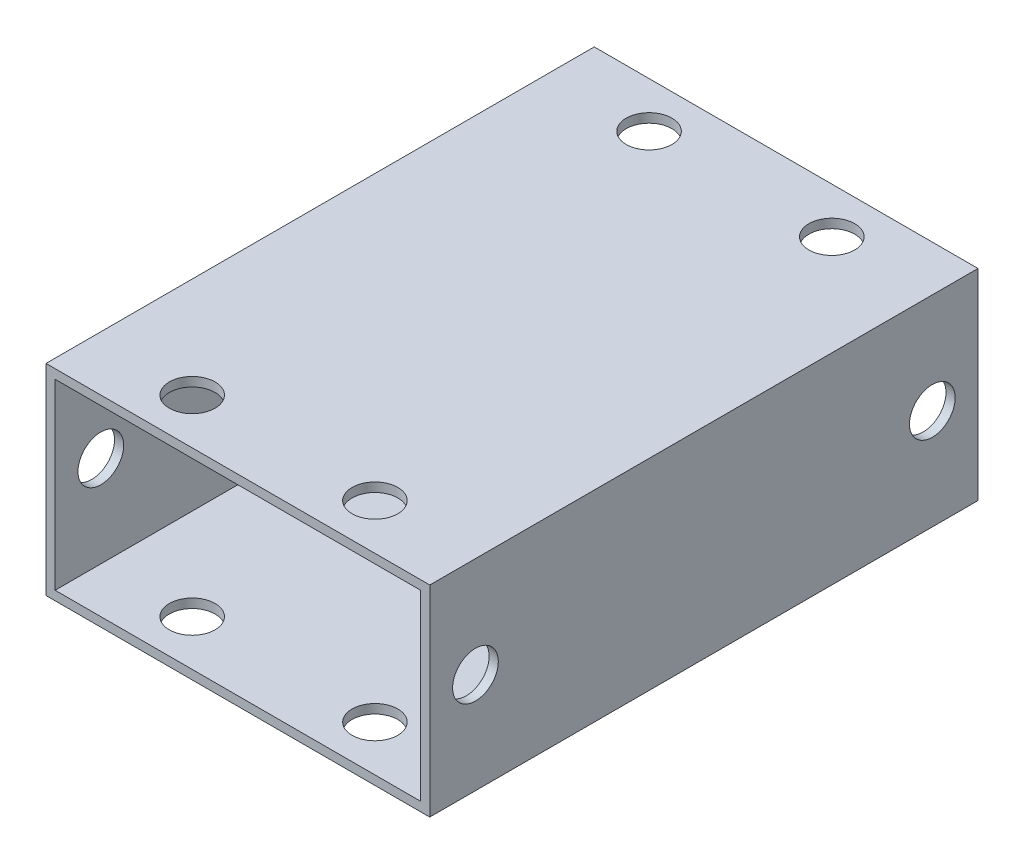
ISO-10303-21;
HEADER;
FILE_DESCRIPTION(('STEP AP214'),'2;1');
FILE_NAME('part.step','',(''),(''),'','','');
FILE_SCHEMA(('AUTOMOTIVE_DESIGN { 1 0 10303 214 1 1 1 1 }'));
ENDSEC;
DATA;
#1=APPLICATION_CONTEXT('core data for automotive mechanical design processes');
#2=APPLICATION_PROTOCOL_DEFINITION('international standard','automotive_design',2000,#1);
#3=PRODUCT_CONTEXT('',#1,'mechanical');
#4=PRODUCT('Part','Part','',(#3));
#5=PRODUCT_RELATED_PRODUCT_CATEGORY('part','',(#4));
#6=PRODUCT_DEFINITION_FORMATION('','',#4);
#7=PRODUCT_DEFINITION_CONTEXT('part definition',#1,'design');
#8=PRODUCT_DEFINITION('design','',#6,#7);
#9=PRODUCT_DEFINITION_SHAPE('','',#8);
#10=(LENGTH_UNIT() NAMED_UNIT(*) SI_UNIT(.MILLI.,.METRE.));
#11=(NAMED_UNIT(*) PLANE_ANGLE_UNIT() SI_UNIT($,.RADIAN.));
#12=(NAMED_UNIT(*) SI_UNIT($,.STERADIAN.) SOLID_ANGLE_UNIT());
#13=UNCERTAINTY_MEASURE_WITH_UNIT(LENGTH_MEASURE(1.E-05),#10,'distance_accuracy_value','');
#14=(GEOMETRIC_REPRESENTATION_CONTEXT(3) GLOBAL_UNCERTAINTY_ASSIGNED_CONTEXT((#13)) GLOBAL_UNIT_ASSIGNED_CONTEXT((#10,
#11,#12)) REPRESENTATION_CONTEXT('',''));
#15=CARTESIAN_POINT('',(0.,0.,0.));
#16=DIRECTION('',(0.,0.,1.));
#17=DIRECTION('',(1.,0.,0.));
#18=AXIS2_PLACEMENT_3D('',#15,#16,#17);
#19=CARTESIAN_POINT('',(20.,-10.,60.));
#20=DIRECTION('',(1.,0.,0.));
#21=DIRECTION('',(0.,0.,-1.));
#22=AXIS2_PLACEMENT_3D('',#19,#20,#21);
#23=PLANE('',#22);
#24=CARTESIAN_POINT('',(20.,0.,5.));
#25=DIRECTION('',(1.,0.,0.));
#26=DIRECTION('',(0.,0.,-1.));
#27=AXIS2_PLACEMENT_3D('',#24,#25,#26);
#28=CIRCLE('',#27,2.5);
#29=CARTESIAN_POINT('',(20.,0.,2.5));
#30=VERTEX_POINT('',#29);
#31=EDGE_CURVE('E143',#30,#30,#28,.T.);
#32=ORIENTED_EDGE('',*,*,#31,.T.);
#33=EDGE_LOOP('',(#32));
#34=FACE_BOUND('',#33,.T.);
#35=CARTESIAN_POINT('',(20.,0.,55.));
#36=DIRECTION('',(1.,0.,0.));
#37=DIRECTION('',(0.,0.,-1.));
#38=AXIS2_PLACEMENT_3D('',#35,#36,#37);
#39=CIRCLE('',#38,2.5);
#40=CARTESIAN_POINT('',(20.,0.,52.5));
#41=VERTEX_POINT('',#40);
#42=EDGE_CURVE('E140',#41,#41,#39,.T.);
#43=ORIENTED_EDGE('',*,*,#42,.T.);
#44=EDGE_LOOP('',(#43));
#45=FACE_BOUND('',#44,.T.);
#46=DIRECTION('',(0.,-1.,0.));
#47=VECTOR('',#46,1.);
#48=CARTESIAN_POINT('',(20.,-10.,0.));
#49=LINE('',#48,#47);
#50=CARTESIAN_POINT('',(20.,10.,0.));
#51=VERTEX_POINT('',#50);
#52=CARTESIAN_POINT('',(20.,-10.,0.));
#53=VERTEX_POINT('',#52);
#54=EDGE_CURVE('E168',#51,#53,#49,.T.);
#55=ORIENTED_EDGE('',*,*,#54,.T.);
#56=DIRECTION('',(0.,0.,-1.));
#57=VECTOR('',#56,1.);
#58=CARTESIAN_POINT('',(20.,-10.,60.));
#59=LINE('',#58,#57);
#60=CARTESIAN_POINT('',(20.,-10.,60.));
#61=VERTEX_POINT('',#60);
#62=EDGE_CURVE('E11',#61,#53,#59,.T.);
#63=ORIENTED_EDGE('',*,*,#62,.F.);
#64=DIRECTION('',(0.,-1.,0.));
#65=VECTOR('',#64,1.);
#66=CARTESIAN_POINT('',(20.,-10.,60.));
#67=LINE('',#66,#65);
#68=CARTESIAN_POINT('',(20.,10.,60.));
#69=VERTEX_POINT('',#68);
#70=EDGE_CURVE('E88',#69,#61,#67,.T.);
#71=ORIENTED_EDGE('',*,*,#70,.F.);
#72=DIRECTION('',(0.,0.,-1.));
#73=VECTOR('',#72,1.);
#74=CARTESIAN_POINT('',(20.,10.,60.));
#75=LINE('',#74,#73);
#76=EDGE_CURVE('E179',#69,#51,#75,.T.);
#77=ORIENTED_EDGE('',*,*,#76,.T.);
#78=EDGE_LOOP('',(#55,#63,#71,#77));
#79=FACE_BOUND('',#78,.T.);
#80=ADVANCED_FACE('F37',(#34,#45,#79),#23,.F.);
#81=CARTESIAN_POINT('',(21.,-10.,60.));
#82=DIRECTION('',(-1.,0.,0.));
#83=DIRECTION('',(0.,0.,1.));
#84=AXIS2_PLACEMENT_3D('',#81,#82,#83);
#85=PLANE('',#84);
#86=CARTESIAN_POINT('',(21.,0.,5.));
#87=DIRECTION('',(-1.,0.,0.));
#88=DIRECTION('',(0.,0.,1.));
#89=AXIS2_PLACEMENT_3D('',#86,#87,#88);
#90=CIRCLE('',#89,2.5);
#91=CARTESIAN_POINT('',(21.,0.,7.5));
#92=VERTEX_POINT('',#91);
#93=EDGE_CURVE('E130',#92,#92,#90,.T.);
#94=ORIENTED_EDGE('',*,*,#93,.T.);
#95=EDGE_LOOP('',(#94));
#96=FACE_BOUND('',#95,.T.);
#97=CARTESIAN_POINT('',(21.,0.,55.));
#98=DIRECTION('',(-1.,0.,0.));
#99=DIRECTION('',(0.,0.,-1.));
#100=AXIS2_PLACEMENT_3D('',#97,#98,#99);
#101=CIRCLE('',#100,2.5);
#102=CARTESIAN_POINT('',(21.,0.,52.5));
#103=VERTEX_POINT('',#102);
#104=EDGE_CURVE('E135',#103,#103,#101,.T.);
#105=ORIENTED_EDGE('',*,*,#104,.T.);
#106=EDGE_LOOP('',(#105));
#107=FACE_BOUND('',#106,.T.);
#108=DIRECTION('',(0.,1.,0.));
#109=VECTOR('',#108,1.);
#110=CARTESIAN_POINT('',(21.,-10.,0.));
#111=LINE('',#110,#109);
#112=CARTESIAN_POINT('',(21.,-11.,0.));
#113=VERTEX_POINT('',#112);
#114=CARTESIAN_POINT('',(21.,11.,0.));
#115=VERTEX_POINT('',#114);
#116=EDGE_CURVE('E181',#113,#115,#111,.T.);
#117=ORIENTED_EDGE('',*,*,#116,.T.);
#118=DIRECTION('',(0.,0.,-1.));
#119=VECTOR('',#118,1.);
#120=CARTESIAN_POINT('',(21.,11.,60.));
#121=LINE('',#120,#119);
#122=CARTESIAN_POINT('',(21.,11.,60.));
#123=VERTEX_POINT('',#122);
#124=EDGE_CURVE('E46',#123,#115,#121,.T.);
#125=ORIENTED_EDGE('',*,*,#124,.F.);
#126=DIRECTION('',(0.,1.,0.));
#127=VECTOR('',#126,1.);
#128=CARTESIAN_POINT('',(21.,-10.,60.));
#129=LINE('',#128,#127);
#130=CARTESIAN_POINT('',(21.,-11.,60.));
#131=VERTEX_POINT('',#130);
#132=EDGE_CURVE('E172',#131,#123,#129,.T.);
#133=ORIENTED_EDGE('',*,*,#132,.F.);
#134=DIRECTION('',(0.,0.,1.));
#135=VECTOR('',#134,1.);
#136=CARTESIAN_POINT('',(21.,-11.,60.));
#137=LINE('',#136,#135);
#138=EDGE_CURVE('E118',#113,#131,#137,.T.);
#139=ORIENTED_EDGE('',*,*,#138,.F.);
#140=EDGE_LOOP('',(#117,#125,#133,#139));
#141=FACE_BOUND('',#140,.T.);
#142=ADVANCED_FACE('F220',(#96,#107,#141),#85,.F.);
#143=CARTESIAN_POINT('',(-21.,11.,60.));
#144=DIRECTION('',(0.,-1.,0.));
#145=DIRECTION('',(0.,0.,-1.));
#146=AXIS2_PLACEMENT_3D('',#143,#144,#145);
#147=PLANE('',#146);
#148=CARTESIAN_POINT('',(-10.,11.,5.));
#149=DIRECTION('',(0.,-1.,0.));
#150=DIRECTION('',(0.,0.,1.));
#151=AXIS2_PLACEMENT_3D('',#148,#149,#150);
#152=CIRCLE('',#151,2.5);
#153=CARTESIAN_POINT('',(-10.,11.,7.5));
#154=VERTEX_POINT('',#153);
#155=EDGE_CURVE('E146',#154,#154,#152,.T.);
#156=ORIENTED_EDGE('',*,*,#155,.T.);
#157=EDGE_LOOP('',(#156));
#158=FACE_BOUND('',#157,.T.);
#159=CARTESIAN_POINT('',(-10.,11.,55.));
#160=DIRECTION('',(0.,-1.,0.));
#161=DIRECTION('',(0.,0.,-1.));
#162=AXIS2_PLACEMENT_3D('',#159,#160,#161);
#163=CIRCLE('',#162,2.5);
#164=CARTESIAN_POINT('',(-10.,11.,52.5));
#165=VERTEX_POINT('',#164);
#166=EDGE_CURVE('E157',#165,#165,#163,.T.);
#167=ORIENTED_EDGE('',*,*,#166,.T.);
#168=EDGE_LOOP('',(#167));
#169=FACE_BOUND('',#168,.T.);
#170=CARTESIAN_POINT('',(10.,11.,55.));
#171=DIRECTION('',(0.,-1.,0.));
#172=DIRECTION('',(0.,0.,1.));
#173=AXIS2_PLACEMENT_3D('',#170,#171,#172);
#174=CIRCLE('',#173,2.5);
#175=CARTESIAN_POINT('',(10.,11.,57.5));
#176=VERTEX_POINT('',#175);
#177=EDGE_CURVE('E151',#176,#176,#174,.T.);
#178=ORIENTED_EDGE('',*,*,#177,.T.);
#179=EDGE_LOOP('',(#178));
#180=FACE_BOUND('',#179,.T.);
#181=CARTESIAN_POINT('',(10.,11.,5.));
#182=DIRECTION('',(0.,-1.,0.));
#183=DIRECTION('',(0.,0.,-1.));
#184=AXIS2_PLACEMENT_3D('',#181,#182,#183);
#185=CIRCLE('',#184,2.5);
#186=CARTESIAN_POINT('',(10.,11.,2.5));
#187=VERTEX_POINT('',#186);
#188=EDGE_CURVE('E165',#187,#187,#185,.T.);
#189=ORIENTED_EDGE('',*,*,#188,.T.);
#190=EDGE_LOOP('',(#189));
#191=FACE_BOUND('',#190,.T.);
#192=DIRECTION('',(-1.,0.,0.));
#193=VECTOR('',#192,1.);
#194=CARTESIAN_POINT('',(-21.,11.,0.));
#195=LINE('',#194,#193);
#196=CARTESIAN_POINT('',(-21.,11.,0.));
#197=VERTEX_POINT('',#196);
#198=EDGE_CURVE('E183',#115,#197,#195,.T.);
#199=ORIENTED_EDGE('',*,*,#198,.T.);
#200=DIRECTION('',(0.,0.,-1.));
#201=VECTOR('',#200,1.);
#202=CARTESIAN_POINT('',(-21.,11.,60.));
#203=LINE('',#202,#201);
#204=CARTESIAN_POINT('',(-21.,11.,60.));
#205=VERTEX_POINT('',#204);
#206=EDGE_CURVE('E112',#205,#197,#203,.T.);
#207=ORIENTED_EDGE('',*,*,#206,.F.);
#208=DIRECTION('',(-1.,0.,0.));
#209=VECTOR('',#208,1.);
#210=CARTESIAN_POINT('',(-21.,11.,60.));
#211=LINE('',#210,#209);
#212=EDGE_CURVE('E174',#123,#205,#211,.T.);
#213=ORIENTED_EDGE('',*,*,#212,.F.);
#214=ORIENTED_EDGE('',*,*,#124,.T.);
#215=EDGE_LOOP('',(#199,#207,#213,#214));
#216=FACE_BOUND('',#215,.T.);
#217=ADVANCED_FACE('F227',(#158,#169,#180,#191,#216),#147,.F.);
#218=CARTESIAN_POINT('',(-21.,-10.,60.));
#219=DIRECTION('',(1.,0.,0.));
#220=DIRECTION('',(0.,0.,-1.));
#221=AXIS2_PLACEMENT_3D('',#218,#219,#220);
#222=PLANE('',#221);
#223=CARTESIAN_POINT('',(-21.,0.,5.));
#224=DIRECTION('',(-1.,0.,0.));
#225=DIRECTION('',(0.,0.,1.));
#226=AXIS2_PLACEMENT_3D('',#223,#224,#225);
#227=CIRCLE('',#226,2.5);
#228=CARTESIAN_POINT('',(-21.,0.,7.5));
#229=VERTEX_POINT('',#228);
#230=EDGE_CURVE('E127',#229,#229,#227,.T.);
#231=ORIENTED_EDGE('',*,*,#230,.F.);
#232=EDGE_LOOP('',(#231));
#233=FACE_BOUND('',#232,.T.);
#234=CARTESIAN_POINT('',(-21.,0.,55.));
#235=DIRECTION('',(-1.,0.,0.));
#236=DIRECTION('',(0.,0.,-1.));
#237=AXIS2_PLACEMENT_3D('',#234,#235,#236);
#238=CIRCLE('',#237,2.5);
#239=CARTESIAN_POINT('',(-21.,0.,52.5));
#240=VERTEX_POINT('',#239);
#241=EDGE_CURVE('E131',#240,#240,#238,.T.);
#242=ORIENTED_EDGE('',*,*,#241,.F.);
#243=EDGE_LOOP('',(#242));
#244=FACE_BOUND('',#243,.T.);
#245=DIRECTION('',(0.,-1.,0.));
#246=VECTOR('',#245,1.);
#247=CARTESIAN_POINT('',(-21.,-10.,0.));
#248=LINE('',#247,#246);
#249=CARTESIAN_POINT('',(-21.,-11.,0.));
#250=VERTEX_POINT('',#249);
#251=EDGE_CURVE('E185',#197,#250,#248,.T.);
#252=ORIENTED_EDGE('',*,*,#251,.T.);
#253=DIRECTION('',(0.,0.,-1.));
#254=VECTOR('',#253,1.);
#255=CARTESIAN_POINT('',(-21.,-11.,60.));
#256=LINE('',#255,#254);
#257=CARTESIAN_POINT('',(-21.,-11.,60.));
#258=VERTEX_POINT('',#257);
#259=EDGE_CURVE('E261',#258,#250,#256,.T.);
#260=ORIENTED_EDGE('',*,*,#259,.F.);
#261=DIRECTION('',(0.,-1.,0.));
#262=VECTOR('',#261,1.);
#263=CARTESIAN_POINT('',(-21.,-10.,60.));
#264=LINE('',#263,#262);
#265=EDGE_CURVE('E104',#205,#258,#264,.T.);
#266=ORIENTED_EDGE('',*,*,#265,.F.);
#267=ORIENTED_EDGE('',*,*,#206,.T.);
#268=EDGE_LOOP('',(#252,#260,#266,#267));
#269=FACE_BOUND('',#268,.T.);
#270=ADVANCED_FACE('F269',(#233,#244,#269),#222,.F.);
#271=CARTESIAN_POINT('',(-20.,-10.,60.));
#272=DIRECTION('',(-1.,0.,0.));
#273=DIRECTION('',(0.,0.,1.));
#274=AXIS2_PLACEMENT_3D('',#271,#272,#273);
#275=PLANE('',#274);
#276=CARTESIAN_POINT('',(-20.,0.,5.));
#277=DIRECTION('',(-1.,0.,0.));
#278=DIRECTION('',(0.,0.,1.));
#279=AXIS2_PLACEMENT_3D('',#276,#277,#278);
#280=CIRCLE('',#279,2.5);
#281=CARTESIAN_POINT('',(-20.,0.,7.5));
#282=VERTEX_POINT('',#281);
#283=EDGE_CURVE('E40',#282,#282,#280,.T.);
#284=ORIENTED_EDGE('',*,*,#283,.T.);
#285=EDGE_LOOP('',(#284));
#286=FACE_BOUND('',#285,.T.);
#287=CARTESIAN_POINT('',(-20.,0.,55.));
#288=DIRECTION('',(-1.,0.,0.));
#289=DIRECTION('',(0.,0.,1.));
#290=AXIS2_PLACEMENT_3D('',#287,#288,#289);
#291=CIRCLE('',#290,2.5);
#292=CARTESIAN_POINT('',(-20.,0.,57.5));
#293=VERTEX_POINT('',#292);
#294=EDGE_CURVE('E134',#293,#293,#291,.T.);
#295=ORIENTED_EDGE('',*,*,#294,.T.);
#296=EDGE_LOOP('',(#295));
#297=FACE_BOUND('',#296,.T.);
#298=DIRECTION('',(0.,1.,0.));
#299=VECTOR('',#298,1.);
#300=CARTESIAN_POINT('',(-20.,-10.,0.));
#301=LINE('',#300,#299);
#302=CARTESIAN_POINT('',(-20.,-10.,0.));
#303=VERTEX_POINT('',#302);
#304=CARTESIAN_POINT('',(-20.,10.,0.));
#305=VERTEX_POINT('',#304);
#306=EDGE_CURVE('E76',#303,#305,#301,.T.);
#307=ORIENTED_EDGE('',*,*,#306,.T.);
#308=DIRECTION('',(0.,0.,-1.));
#309=VECTOR('',#308,1.);
#310=CARTESIAN_POINT('',(-20.,10.,60.));
#311=LINE('',#310,#309);
#312=CARTESIAN_POINT('',(-20.,10.,60.));
#313=VERTEX_POINT('',#312);
#314=EDGE_CURVE('E103',#313,#305,#311,.T.);
#315=ORIENTED_EDGE('',*,*,#314,.F.);
#316=DIRECTION('',(0.,1.,0.));
#317=VECTOR('',#316,1.);
#318=CARTESIAN_POINT('',(-20.,-10.,60.));
#319=LINE('',#318,#317);
#320=CARTESIAN_POINT('',(-20.,-10.,60.));
#321=VERTEX_POINT('',#320);
#322=EDGE_CURVE('E98',#321,#313,#319,.T.);
#323=ORIENTED_EDGE('',*,*,#322,.F.);
#324=DIRECTION('',(0.,0.,-1.));
#325=VECTOR('',#324,1.);
#326=CARTESIAN_POINT('',(-20.,-10.,60.));
#327=LINE('',#326,#325);
#328=EDGE_CURVE('E101',#321,#303,#327,.T.);
#329=ORIENTED_EDGE('',*,*,#328,.T.);
#330=EDGE_LOOP('',(#307,#315,#323,#329));
#331=FACE_BOUND('',#330,.T.);
#332=ADVANCED_FACE('F100',(#286,#297,#331),#275,.F.);
#333=CARTESIAN_POINT('',(-20.,10.,60.));
#334=DIRECTION('',(0.,1.,0.));
#335=DIRECTION('',(0.,0.,1.));
#336=AXIS2_PLACEMENT_3D('',#333,#334,#335);
#337=PLANE('',#336);
#338=CARTESIAN_POINT('',(-10.,10.,5.));
#339=DIRECTION('',(0.,-1.,0.));
#340=DIRECTION('',(0.,0.,1.));
#341=AXIS2_PLACEMENT_3D('',#338,#339,#340);
#342=CIRCLE('',#341,2.5);
#343=CARTESIAN_POINT('',(-10.,10.,7.5));
#344=VERTEX_POINT('',#343);
#345=EDGE_CURVE('E160',#344,#344,#342,.T.);
#346=ORIENTED_EDGE('',*,*,#345,.F.);
#347=EDGE_LOOP('',(#346));
#348=FACE_BOUND('',#347,.T.);
#349=CARTESIAN_POINT('',(-10.,10.,55.));
#350=DIRECTION('',(0.,-1.,0.));
#351=DIRECTION('',(0.,0.,-1.));
#352=AXIS2_PLACEMENT_3D('',#349,#350,#351);
#353=CIRCLE('',#352,2.5);
#354=CARTESIAN_POINT('',(-10.,10.,52.5));
#355=VERTEX_POINT('',#354);
#356=EDGE_CURVE('E154',#355,#355,#353,.T.);
#357=ORIENTED_EDGE('',*,*,#356,.F.);
#358=EDGE_LOOP('',(#357));
#359=FACE_BOUND('',#358,.T.);
#360=CARTESIAN_POINT('',(10.,10.,55.));
#361=DIRECTION('',(0.,-1.,0.));
#362=DIRECTION('',(0.,0.,1.));
#363=AXIS2_PLACEMENT_3D('',#360,#361,#362);
#364=CIRCLE('',#363,2.5);
#365=CARTESIAN_POINT('',(10.,10.,57.5));
#366=VERTEX_POINT('',#365);
#367=EDGE_CURVE('E147',#366,#366,#364,.T.);
#368=ORIENTED_EDGE('',*,*,#367,.F.);
#369=EDGE_LOOP('',(#368));
#370=FACE_BOUND('',#369,.T.);
#371=CARTESIAN_POINT('',(10.,10.,5.));
#372=DIRECTION('',(0.,-1.,0.));
#373=DIRECTION('',(0.,0.,-1.));
#374=AXIS2_PLACEMENT_3D('',#371,#372,#373);
#375=CIRCLE('',#374,2.5);
#376=CARTESIAN_POINT('',(10.,10.,2.5));
#377=VERTEX_POINT('',#376);
#378=EDGE_CURVE('E150',#377,#377,#375,.T.);
#379=ORIENTED_EDGE('',*,*,#378,.F.);
#380=EDGE_LOOP('',(#379));
#381=FACE_BOUND('',#380,.T.);
#382=DIRECTION('',(1.,0.,0.));
#383=VECTOR('',#382,1.);
#384=CARTESIAN_POINT('',(-20.,10.,0.));
#385=LINE('',#384,#383);
#386=EDGE_CURVE('E82',#305,#51,#385,.T.);
#387=ORIENTED_EDGE('',*,*,#386,.T.);
#388=ORIENTED_EDGE('',*,*,#76,.F.);
#389=DIRECTION('',(1.,0.,0.));
#390=VECTOR('',#389,1.);
#391=CARTESIAN_POINT('',(-20.,10.,60.));
#392=LINE('',#391,#390);
#393=EDGE_CURVE('E55',#313,#69,#392,.T.);
#394=ORIENTED_EDGE('',*,*,#393,.F.);
#395=ORIENTED_EDGE('',*,*,#314,.T.);
#396=EDGE_LOOP('',(#387,#388,#394,#395));
#397=FACE_BOUND('',#396,.T.);
#398=ADVANCED_FACE('F285',(#348,#359,#370,#381,#397),#337,.F.);
#399=CARTESIAN_POINT('',(0.,0.,60.));
#400=DIRECTION('',(0.,0.,-1.));
#401=DIRECTION('',(-1.,0.,0.));
#402=AXIS2_PLACEMENT_3D('',#399,#400,#401);
#403=PLANE('',#402);
#404=DIRECTION('',(-1.,0.,0.));
#405=VECTOR('',#404,1.);
#406=CARTESIAN_POINT('',(21.,-10.,60.));
#407=LINE('',#406,#405);
#408=EDGE_CURVE('E109',#61,#321,#407,.T.);
#409=ORIENTED_EDGE('',*,*,#408,.T.);
#410=ORIENTED_EDGE('',*,*,#322,.T.);
#411=ORIENTED_EDGE('',*,*,#393,.T.);
#412=ORIENTED_EDGE('',*,*,#70,.T.);
#413=EDGE_LOOP('',(#409,#410,#411,#412));
#414=FACE_BOUND('',#413,.T.);
#415=ORIENTED_EDGE('',*,*,#265,.T.);
#416=DIRECTION('',(-1.,0.,0.));
#417=VECTOR('',#416,1.);
#418=CARTESIAN_POINT('',(21.,-11.,60.));
#419=LINE('',#418,#417);
#420=EDGE_CURVE('E256',#131,#258,#419,.T.);
#421=ORIENTED_EDGE('',*,*,#420,.F.);
#422=ORIENTED_EDGE('',*,*,#132,.T.);
#423=ORIENTED_EDGE('',*,*,#212,.T.);
#424=EDGE_LOOP('',(#415,#421,#422,#423));
#425=FACE_BOUND('',#424,.T.);
#426=ADVANCED_FACE('F114',(#414,#425),#403,.F.);
#427=CARTESIAN_POINT('',(0.,0.,0.));
#428=DIRECTION('',(0.,0.,-1.));
#429=DIRECTION('',(-1.,0.,0.));
#430=AXIS2_PLACEMENT_3D('',#427,#428,#429);
#431=PLANE('',#430);
#432=ORIENTED_EDGE('',*,*,#306,.F.);
#433=DIRECTION('',(1.,0.,0.));
#434=VECTOR('',#433,1.);
#435=CARTESIAN_POINT('',(21.,-10.,0.));
#436=LINE('',#435,#434);
#437=EDGE_CURVE('E111',#303,#53,#436,.T.);
#438=ORIENTED_EDGE('',*,*,#437,.T.);
#439=ORIENTED_EDGE('',*,*,#54,.F.);
#440=ORIENTED_EDGE('',*,*,#386,.F.);
#441=EDGE_LOOP('',(#432,#438,#439,#440));
#442=FACE_BOUND('',#441,.T.);
#443=DIRECTION('',(1.,0.,0.));
#444=VECTOR('',#443,1.);
#445=CARTESIAN_POINT('',(21.,-11.,0.));
#446=LINE('',#445,#444);
#447=EDGE_CURVE('E124',#250,#113,#446,.T.);
#448=ORIENTED_EDGE('',*,*,#447,.F.);
#449=ORIENTED_EDGE('',*,*,#251,.F.);
#450=ORIENTED_EDGE('',*,*,#198,.F.);
#451=ORIENTED_EDGE('',*,*,#116,.F.);
#452=EDGE_LOOP('',(#448,#449,#450,#451));
#453=FACE_BOUND('',#452,.T.);
#454=ADVANCED_FACE('F235',(#442,#453),#431,.T.);
#455=CARTESIAN_POINT('',(10.,11.,5.));
#456=DIRECTION('',(0.,-1.,0.));
#457=DIRECTION('',(0.,0.,-1.));
#458=AXIS2_PLACEMENT_3D('',#455,#456,#457);
#459=CYLINDRICAL_SURFACE('',#458,2.5);
#460=ORIENTED_EDGE('',*,*,#188,.F.);
#461=EDGE_LOOP('',(#460));
#462=FACE_BOUND('',#461,.T.);
#463=ORIENTED_EDGE('',*,*,#378,.T.);
#464=EDGE_LOOP('',(#463));
#465=FACE_BOUND('',#464,.T.);
#466=ADVANCED_FACE('F292',(#462,#465),#459,.F.);
#467=CARTESIAN_POINT('',(10.,11.,55.));
#468=DIRECTION('',(0.,-1.,0.));
#469=DIRECTION('',(0.,0.,-1.));
#470=AXIS2_PLACEMENT_3D('',#467,#468,#469);
#471=CYLINDRICAL_SURFACE('',#470,2.5);
#472=ORIENTED_EDGE('',*,*,#177,.F.);
#473=EDGE_LOOP('',(#472));
#474=FACE_BOUND('',#473,.T.);
#475=ORIENTED_EDGE('',*,*,#367,.T.);
#476=EDGE_LOOP('',(#475));
#477=FACE_BOUND('',#476,.T.);
#478=ADVANCED_FACE('F296',(#474,#477),#471,.F.);
#479=CARTESIAN_POINT('',(-10.,11.,55.));
#480=DIRECTION('',(0.,-1.,0.));
#481=DIRECTION('',(0.,0.,-1.));
#482=AXIS2_PLACEMENT_3D('',#479,#480,#481);
#483=CYLINDRICAL_SURFACE('',#482,2.5);
#484=ORIENTED_EDGE('',*,*,#166,.F.);
#485=EDGE_LOOP('',(#484));
#486=FACE_BOUND('',#485,.T.);
#487=ORIENTED_EDGE('',*,*,#356,.T.);
#488=EDGE_LOOP('',(#487));
#489=FACE_BOUND('',#488,.T.);
#490=ADVANCED_FACE('F213',(#486,#489),#483,.F.);
#491=CARTESIAN_POINT('',(-10.,11.,5.));
#492=DIRECTION('',(0.,-1.,0.));
#493=DIRECTION('',(0.,0.,-1.));
#494=AXIS2_PLACEMENT_3D('',#491,#492,#493);
#495=CYLINDRICAL_SURFACE('',#494,2.5);
#496=ORIENTED_EDGE('',*,*,#155,.F.);
#497=EDGE_LOOP('',(#496));
#498=FACE_BOUND('',#497,.T.);
#499=ORIENTED_EDGE('',*,*,#345,.T.);
#500=EDGE_LOOP('',(#499));
#501=FACE_BOUND('',#500,.T.);
#502=ADVANCED_FACE('F202',(#498,#501),#495,.F.);
#503=CARTESIAN_POINT('',(21.,0.,55.));
#504=DIRECTION('',(-1.,0.,0.));
#505=DIRECTION('',(0.,0.,1.));
#506=AXIS2_PLACEMENT_3D('',#503,#504,#505);
#507=CYLINDRICAL_SURFACE('',#506,2.5);
#508=ORIENTED_EDGE('',*,*,#241,.T.);
#509=EDGE_LOOP('',(#508));
#510=FACE_BOUND('',#509,.T.);
#511=ORIENTED_EDGE('',*,*,#294,.F.);
#512=EDGE_LOOP('',(#511));
#513=FACE_BOUND('',#512,.T.);
#514=ADVANCED_FACE('F199',(#510,#513),#507,.F.);
#515=CARTESIAN_POINT('',(21.,0.,5.));
#516=DIRECTION('',(-1.,0.,0.));
#517=DIRECTION('',(0.,0.,1.));
#518=AXIS2_PLACEMENT_3D('',#515,#516,#517);
#519=CYLINDRICAL_SURFACE('',#518,2.5);
#520=ORIENTED_EDGE('',*,*,#230,.T.);
#521=EDGE_LOOP('',(#520));
#522=FACE_BOUND('',#521,.T.);
#523=ORIENTED_EDGE('',*,*,#283,.F.);
#524=EDGE_LOOP('',(#523));
#525=FACE_BOUND('',#524,.T.);
#526=ADVANCED_FACE('F201',(#522,#525),#519,.F.);
#527=ORIENTED_EDGE('',*,*,#104,.F.);
#528=EDGE_LOOP('',(#527));
#529=FACE_BOUND('',#528,.T.);
#530=ORIENTED_EDGE('',*,*,#42,.F.);
#531=EDGE_LOOP('',(#530));
#532=FACE_BOUND('',#531,.T.);
#533=ADVANCED_FACE('F205',(#529,#532),#507,.F.);
#534=ORIENTED_EDGE('',*,*,#93,.F.);
#535=EDGE_LOOP('',(#534));
#536=FACE_BOUND('',#535,.T.);
#537=ORIENTED_EDGE('',*,*,#31,.F.);
#538=EDGE_LOOP('',(#537));
#539=FACE_BOUND('',#538,.T.);
#540=ADVANCED_FACE('F212',(#536,#539),#519,.F.);
#541=CARTESIAN_POINT('',(0.,-10.,0.));
#542=DIRECTION('',(0.,1.,0.));
#543=DIRECTION('',(0.,0.,1.));
#544=AXIS2_PLACEMENT_3D('',#541,#542,#543);
#545=PLANE('',#544);
#546=CARTESIAN_POINT('',(10.,-10.,55.));
#547=DIRECTION('',(0.,-1.,0.));
#548=DIRECTION('',(0.,0.,-1.));
#549=AXIS2_PLACEMENT_3D('',#546,#547,#548);
#550=CIRCLE('',#549,2.5);
#551=CARTESIAN_POINT('',(10.,-10.,52.5));
#552=VERTEX_POINT('',#551);
#553=EDGE_CURVE('E524',#552,#552,#550,.T.);
#554=ORIENTED_EDGE('',*,*,#553,.T.);
#555=EDGE_LOOP('',(#554));
#556=FACE_BOUND('',#555,.T.);
#557=CARTESIAN_POINT('',(-10.,-10.,5.));
#558=DIRECTION('',(0.,-1.,0.));
#559=DIRECTION('',(0.,0.,-1.));
#560=AXIS2_PLACEMENT_3D('',#557,#558,#559);
#561=CIRCLE('',#560,2.5);
#562=CARTESIAN_POINT('',(-10.,-10.,2.5));
#563=VERTEX_POINT('',#562);
#564=EDGE_CURVE('E121',#563,#563,#561,.T.);
#565=ORIENTED_EDGE('',*,*,#564,.T.);
#566=EDGE_LOOP('',(#565));
#567=FACE_BOUND('',#566,.T.);
#568=CARTESIAN_POINT('',(-10.,-10.,55.));
#569=DIRECTION('',(0.,-1.,0.));
#570=DIRECTION('',(0.,0.,-1.));
#571=AXIS2_PLACEMENT_3D('',#568,#569,#570);
#572=CIRCLE('',#571,2.5);
#573=CARTESIAN_POINT('',(-10.,-10.,52.5));
#574=VERTEX_POINT('',#573);
#575=EDGE_CURVE('E530',#574,#574,#572,.T.);
#576=ORIENTED_EDGE('',*,*,#575,.T.);
#577=EDGE_LOOP('',(#576));
#578=FACE_BOUND('',#577,.T.);
#579=CARTESIAN_POINT('',(10.,-10.,5.));
#580=DIRECTION('',(0.,-1.,0.));
#581=DIRECTION('',(0.,0.,-1.));
#582=AXIS2_PLACEMENT_3D('',#579,#580,#581);
#583=CIRCLE('',#582,2.5);
#584=CARTESIAN_POINT('',(10.,-10.,2.5));
#585=VERTEX_POINT('',#584);
#586=EDGE_CURVE('E521',#585,#585,#583,.T.);
#587=ORIENTED_EDGE('',*,*,#586,.T.);
#588=EDGE_LOOP('',(#587));
#589=FACE_BOUND('',#588,.T.);
#590=ORIENTED_EDGE('',*,*,#62,.T.);
#591=ORIENTED_EDGE('',*,*,#437,.F.);
#592=ORIENTED_EDGE('',*,*,#328,.F.);
#593=ORIENTED_EDGE('',*,*,#408,.F.);
#594=EDGE_LOOP('',(#590,#591,#592,#593));
#595=FACE_BOUND('',#594,.T.);
#596=ADVANCED_FACE('F108',(#556,#567,#578,#589,#595),#545,.T.);
#597=CARTESIAN_POINT('',(0.,-11.,0.));
#598=DIRECTION('',(0.,1.,0.));
#599=DIRECTION('',(0.,0.,1.));
#600=AXIS2_PLACEMENT_3D('',#597,#598,#599);
#601=PLANE('',#600);
#602=ORIENTED_EDGE('',*,*,#138,.T.);
#603=ORIENTED_EDGE('',*,*,#420,.T.);
#604=ORIENTED_EDGE('',*,*,#259,.T.);
#605=ORIENTED_EDGE('',*,*,#447,.T.);
#606=EDGE_LOOP('',(#602,#603,#604,#605));
#607=FACE_BOUND('',#606,.T.);
#608=CARTESIAN_POINT('',(-10.,-11.,5.));
#609=DIRECTION('',(0.,-1.,0.));
#610=DIRECTION('',(0.,0.,-1.));
#611=AXIS2_PLACEMENT_3D('',#608,#609,#610);
#612=CIRCLE('',#611,2.5);
#613=CARTESIAN_POINT('',(-10.,-11.,2.5));
#614=VERTEX_POINT('',#613);
#615=EDGE_CURVE('E116',#614,#614,#612,.T.);
#616=ORIENTED_EDGE('',*,*,#615,.F.);
#617=EDGE_LOOP('',(#616));
#618=FACE_BOUND('',#617,.T.);
#619=CARTESIAN_POINT('',(-10.,-11.,55.));
#620=DIRECTION('',(0.,-1.,0.));
#621=DIRECTION('',(0.,0.,-1.));
#622=AXIS2_PLACEMENT_3D('',#619,#620,#621);
#623=CIRCLE('',#622,2.5);
#624=CARTESIAN_POINT('',(-10.,-11.,52.5));
#625=VERTEX_POINT('',#624);
#626=EDGE_CURVE('E533',#625,#625,#623,.T.);
#627=ORIENTED_EDGE('',*,*,#626,.F.);
#628=EDGE_LOOP('',(#627));
#629=FACE_BOUND('',#628,.T.);
#630=CARTESIAN_POINT('',(10.,-11.,55.));
#631=DIRECTION('',(0.,-1.,0.));
#632=DIRECTION('',(0.,0.,-1.));
#633=AXIS2_PLACEMENT_3D('',#630,#631,#632);
#634=CIRCLE('',#633,2.5);
#635=CARTESIAN_POINT('',(10.,-11.,52.5));
#636=VERTEX_POINT('',#635);
#637=EDGE_CURVE('E527',#636,#636,#634,.T.);
#638=ORIENTED_EDGE('',*,*,#637,.F.);
#639=EDGE_LOOP('',(#638));
#640=FACE_BOUND('',#639,.T.);
#641=CARTESIAN_POINT('',(10.,-11.,5.));
#642=DIRECTION('',(0.,-1.,0.));
#643=DIRECTION('',(0.,0.,-1.));
#644=AXIS2_PLACEMENT_3D('',#641,#642,#643);
#645=CIRCLE('',#644,2.5);
#646=CARTESIAN_POINT('',(10.,-11.,2.5));
#647=VERTEX_POINT('',#646);
#648=EDGE_CURVE('E518',#647,#647,#645,.T.);
#649=ORIENTED_EDGE('',*,*,#648,.F.);
#650=EDGE_LOOP('',(#649));
#651=FACE_BOUND('',#650,.T.);
#652=ADVANCED_FACE('F263',(#607,#618,#629,#640,#651),#601,.F.);
#653=CARTESIAN_POINT('',(-10.,-11.,5.));
#654=DIRECTION('',(0.,1.,0.));
#655=DIRECTION('',(0.,0.,1.));
#656=AXIS2_PLACEMENT_3D('',#653,#654,#655);
#657=CYLINDRICAL_SURFACE('',#656,2.5);
#658=ORIENTED_EDGE('',*,*,#615,.T.);
#659=EDGE_LOOP('',(#658));
#660=FACE_BOUND('',#659,.T.);
#661=ORIENTED_EDGE('',*,*,#564,.F.);
#662=EDGE_LOOP('',(#661));
#663=FACE_BOUND('',#662,.T.);
#664=ADVANCED_FACE('F383',(#660,#663),#657,.F.);
#665=CARTESIAN_POINT('',(-10.,-11.,55.));
#666=DIRECTION('',(0.,1.,0.));
#667=DIRECTION('',(0.,0.,1.));
#668=AXIS2_PLACEMENT_3D('',#665,#666,#667);
#669=CYLINDRICAL_SURFACE('',#668,2.5);
#670=ORIENTED_EDGE('',*,*,#626,.T.);
#671=EDGE_LOOP('',(#670));
#672=FACE_BOUND('',#671,.T.);
#673=ORIENTED_EDGE('',*,*,#575,.F.);
#674=EDGE_LOOP('',(#673));
#675=FACE_BOUND('',#674,.T.);
#676=ADVANCED_FACE('F390',(#672,#675),#669,.F.);
#677=CARTESIAN_POINT('',(10.,-11.,55.));
#678=DIRECTION('',(0.,1.,0.));
#679=DIRECTION('',(0.,0.,1.));
#680=AXIS2_PLACEMENT_3D('',#677,#678,#679);
#681=CYLINDRICAL_SURFACE('',#680,2.5);
#682=ORIENTED_EDGE('',*,*,#637,.T.);
#683=EDGE_LOOP('',(#682));
#684=FACE_BOUND('',#683,.T.);
#685=ORIENTED_EDGE('',*,*,#553,.F.);
#686=EDGE_LOOP('',(#685));
#687=FACE_BOUND('',#686,.T.);
#688=ADVANCED_FACE('F398',(#684,#687),#681,.F.);
#689=CARTESIAN_POINT('',(10.,-11.,5.));
#690=DIRECTION('',(0.,1.,0.));
#691=DIRECTION('',(0.,0.,1.));
#692=AXIS2_PLACEMENT_3D('',#689,#690,#691);
#693=CYLINDRICAL_SURFACE('',#692,2.5);
#694=ORIENTED_EDGE('',*,*,#648,.T.);
#695=EDGE_LOOP('',(#694));
#696=FACE_BOUND('',#695,.T.);
#697=ORIENTED_EDGE('',*,*,#586,.F.);
#698=EDGE_LOOP('',(#697));
#699=FACE_BOUND('',#698,.T.);
#700=ADVANCED_FACE('F406',(#696,#699),#693,.F.);
#701=CLOSED_SHELL('',(#80,#142,#217,#270,#332,#398,#426,#454,#466,#478,#490,#502,#514,#526,#533,
#540,#596,#652,#664,#676,#688,#700));
#702=MANIFOLD_SOLID_BREP('B2',#701);
#703=ADVANCED_BREP_SHAPE_REPRESENTATION('',(#18,#702),#14);
#704=SHAPE_DEFINITION_REPRESENTATION(#9,#703);
ENDSEC;
END-ISO-10303-21;
